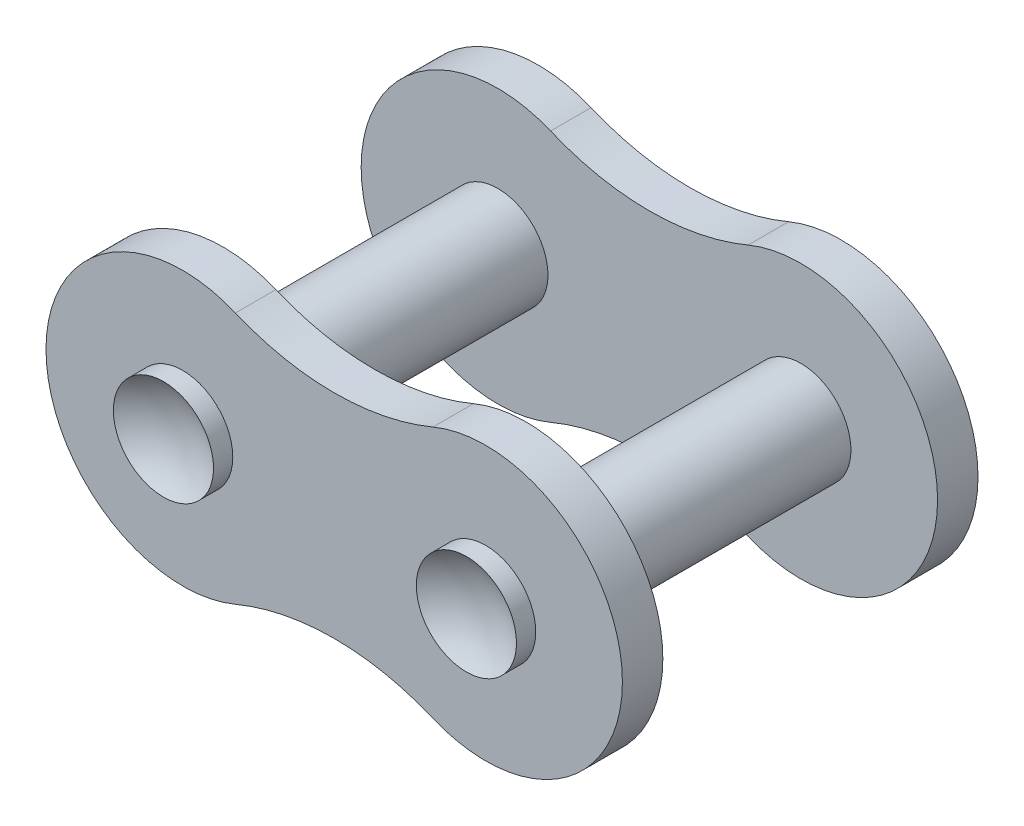
ISO-10303-21;
HEADER;
FILE_DESCRIPTION(('STEP AP214'),'2;1');
FILE_NAME('part.step','',(''),(''),'','','');
FILE_SCHEMA(('AUTOMOTIVE_DESIGN { 1 0 10303 214 1 1 1 1 }'));
ENDSEC;
DATA;
#1=APPLICATION_CONTEXT('core data for automotive mechanical design processes');
#2=APPLICATION_PROTOCOL_DEFINITION('international standard','automotive_design',2000,#1);
#3=PRODUCT_CONTEXT('',#1,'mechanical');
#4=PRODUCT('Part','Part','',(#3));
#5=PRODUCT_RELATED_PRODUCT_CATEGORY('part','',(#4));
#6=PRODUCT_DEFINITION_FORMATION('','',#4);
#7=PRODUCT_DEFINITION_CONTEXT('part definition',#1,'design');
#8=PRODUCT_DEFINITION('design','',#6,#7);
#9=PRODUCT_DEFINITION_SHAPE('','',#8);
#10=(LENGTH_UNIT() NAMED_UNIT(*) SI_UNIT(.MILLI.,.METRE.));
#11=(NAMED_UNIT(*) PLANE_ANGLE_UNIT() SI_UNIT($,.RADIAN.));
#12=(NAMED_UNIT(*) SI_UNIT($,.STERADIAN.) SOLID_ANGLE_UNIT());
#13=UNCERTAINTY_MEASURE_WITH_UNIT(LENGTH_MEASURE(1.E-05),#10,'distance_accuracy_value','');
#14=(GEOMETRIC_REPRESENTATION_CONTEXT(3) GLOBAL_UNCERTAINTY_ASSIGNED_CONTEXT((#13)) GLOBAL_UNIT_ASSIGNED_CONTEXT((#10,
#11,#12)) REPRESENTATION_CONTEXT('',''));
#15=CARTESIAN_POINT('',(0.,0.,0.));
#16=DIRECTION('',(0.,0.,1.));
#17=DIRECTION('',(1.,0.,0.));
#18=AXIS2_PLACEMENT_3D('',#15,#16,#17);
#19=CARTESIAN_POINT('',(-5.9944,0.,7.7978));
#20=DIRECTION('',(0.,0.,-1.));
#21=DIRECTION('',(-1.,0.,0.));
#22=AXIS2_PLACEMENT_3D('',#19,#20,#21);
#23=CYLINDRICAL_SURFACE('',#22,1.9812);
#24=CARTESIAN_POINT('',(-5.9944,0.,5.4356));
#25=DIRECTION('',(0.,0.,1.));
#26=DIRECTION('',(1.,0.,0.));
#27=AXIS2_PLACEMENT_3D('',#24,#25,#26);
#28=CIRCLE('',#27,1.9812);
#29=CARTESIAN_POINT('',(-4.0132,0.,5.4356));
#30=VERTEX_POINT('',#29);
#31=EDGE_CURVE('E163',#30,#30,#28,.T.);
#32=ORIENTED_EDGE('',*,*,#31,.F.);
#33=EDGE_LOOP('',(#32));
#34=FACE_BOUND('',#33,.T.);
#35=CARTESIAN_POINT('',(-5.9944,0.,-5.4356));
#36=DIRECTION('',(0.,0.,-1.));
#37=DIRECTION('',(-1.,0.,0.));
#38=AXIS2_PLACEMENT_3D('',#35,#36,#37);
#39=CIRCLE('',#38,1.9812);
#40=CARTESIAN_POINT('',(-7.9756,0.,-5.4356));
#41=VERTEX_POINT('',#40);
#42=EDGE_CURVE('E11',#41,#41,#39,.T.);
#43=ORIENTED_EDGE('',*,*,#42,.F.);
#44=EDGE_LOOP('',(#43));
#45=FACE_BOUND('',#44,.T.);
#46=ADVANCED_FACE('F33',(#34,#45),#23,.T.);
#47=CARTESIAN_POINT('',(5.9944,0.,7.7978));
#48=DIRECTION('',(0.,0.,-1.));
#49=DIRECTION('',(-1.,0.,0.));
#50=AXIS2_PLACEMENT_3D('',#47,#48,#49);
#51=CYLINDRICAL_SURFACE('',#50,1.9812);
#52=CARTESIAN_POINT('',(5.9944,0.,5.4356));
#53=DIRECTION('',(0.,0.,1.));
#54=DIRECTION('',(1.,0.,0.));
#55=AXIS2_PLACEMENT_3D('',#52,#53,#54);
#56=CIRCLE('',#55,1.9812);
#57=CARTESIAN_POINT('',(7.9756,0.,5.4356));
#58=VERTEX_POINT('',#57);
#59=EDGE_CURVE('E160',#58,#58,#56,.F.);
#60=ORIENTED_EDGE('',*,*,#59,.T.);
#61=EDGE_LOOP('',(#60));
#62=FACE_BOUND('',#61,.T.);
#63=CARTESIAN_POINT('',(5.9944,0.,-5.4356));
#64=DIRECTION('',(0.,0.,-1.));
#65=DIRECTION('',(-1.,0.,0.));
#66=AXIS2_PLACEMENT_3D('',#63,#64,#65);
#67=CIRCLE('',#66,1.9812);
#68=CARTESIAN_POINT('',(4.0132,0.,-5.4356));
#69=VERTEX_POINT('',#68);
#70=EDGE_CURVE('E37',#69,#69,#67,.T.);
#71=ORIENTED_EDGE('',*,*,#70,.F.);
#72=EDGE_LOOP('',(#71));
#73=FACE_BOUND('',#72,.T.);
#74=ADVANCED_FACE('F221',(#62,#73),#51,.T.);
#75=CARTESIAN_POINT('',(0.,14.3425233372653,5.4356));
#76=DIRECTION('',(0.,0.,1.));
#77=DIRECTION('',(1.,0.,0.));
#78=AXIS2_PLACEMENT_3D('',#75,#76,#77);
#79=CYLINDRICAL_SURFACE('',#78,10.1346);
#80=CARTESIAN_POINT('',(0.,14.3425233372653,7.0358));
#81=DIRECTION('',(0.,0.,-1.));
#82=DIRECTION('',(1.,0.,0.));
#83=AXIS2_PLACEMENT_3D('',#80,#81,#82);
#84=CIRCLE('',#83,10.1346);
#85=CARTESIAN_POINT('',(3.9081137254902,4.99176057326391,7.0358));
#86=VERTEX_POINT('',#85);
#87=CARTESIAN_POINT('',(-3.9081137254902,4.99176057326391,7.0358));
#88=VERTEX_POINT('',#87);
#89=EDGE_CURVE('E173',#86,#88,#84,.T.);
#90=ORIENTED_EDGE('',*,*,#89,.F.);
#91=DIRECTION('',(0.,0.,1.));
#92=VECTOR('',#91,1.);
#93=CARTESIAN_POINT('',(3.9081137254902,4.99176057326391,5.4356));
#94=LINE('',#93,#92);
#95=CARTESIAN_POINT('',(3.9081137254902,4.99176057326391,5.4356));
#96=VERTEX_POINT('',#95);
#97=EDGE_CURVE('E51',#96,#86,#94,.T.);
#98=ORIENTED_EDGE('',*,*,#97,.F.);
#99=CARTESIAN_POINT('',(0.,14.3425233372653,5.4356));
#100=DIRECTION('',(0.,0.,-1.));
#101=DIRECTION('',(1.,0.,0.));
#102=AXIS2_PLACEMENT_3D('',#99,#100,#101);
#103=CIRCLE('',#102,10.1346);
#104=CARTESIAN_POINT('',(-3.9081137254902,4.99176057326391,5.4356));
#105=VERTEX_POINT('',#104);
#106=EDGE_CURVE('E164',#96,#105,#103,.T.);
#107=ORIENTED_EDGE('',*,*,#106,.T.);
#108=DIRECTION('',(0.,0.,1.));
#109=VECTOR('',#108,1.);
#110=CARTESIAN_POINT('',(-3.9081137254902,4.99176057326391,5.4356));
#111=LINE('',#110,#109);
#112=EDGE_CURVE('E80',#105,#88,#111,.T.);
#113=ORIENTED_EDGE('',*,*,#112,.T.);
#114=EDGE_LOOP('',(#90,#98,#107,#113));
#115=FACE_BOUND('',#114,.T.);
#116=ADVANCED_FACE('F226',(#115),#79,.F.);
#117=CARTESIAN_POINT('',(5.9944,0.,5.4356));
#118=DIRECTION('',(0.,0.,1.));
#119=DIRECTION('',(1.,0.,0.));
#120=AXIS2_PLACEMENT_3D('',#117,#118,#119);
#121=CYLINDRICAL_SURFACE('',#120,5.4102);
#122=CARTESIAN_POINT('',(5.9944,0.,7.0358));
#123=DIRECTION('',(0.,0.,1.));
#124=DIRECTION('',(1.,0.,0.));
#125=AXIS2_PLACEMENT_3D('',#122,#123,#124);
#126=CIRCLE('',#125,5.4102);
#127=CARTESIAN_POINT('',(3.9081137254902,-4.9917605732639,7.0358));
#128=VERTEX_POINT('',#127);
#129=EDGE_CURVE('E167',#128,#86,#126,.T.);
#130=ORIENTED_EDGE('',*,*,#129,.F.);
#131=DIRECTION('',(0.,0.,1.));
#132=VECTOR('',#131,1.);
#133=CARTESIAN_POINT('',(3.9081137254902,-4.9917605732639,5.4356));
#134=LINE('',#133,#132);
#135=CARTESIAN_POINT('',(3.9081137254902,-4.9917605732639,5.4356));
#136=VERTEX_POINT('',#135);
#137=EDGE_CURVE('E69',#136,#128,#134,.T.);
#138=ORIENTED_EDGE('',*,*,#137,.F.);
#139=CARTESIAN_POINT('',(5.9944,0.,5.4356));
#140=DIRECTION('',(0.,0.,1.));
#141=DIRECTION('',(1.,0.,0.));
#142=AXIS2_PLACEMENT_3D('',#139,#140,#141);
#143=CIRCLE('',#142,5.4102);
#144=EDGE_CURVE('E171',#136,#96,#143,.T.);
#145=ORIENTED_EDGE('',*,*,#144,.T.);
#146=ORIENTED_EDGE('',*,*,#97,.T.);
#147=EDGE_LOOP('',(#130,#138,#145,#146));
#148=FACE_BOUND('',#147,.T.);
#149=ADVANCED_FACE('F388',(#148),#121,.T.);
#150=CARTESIAN_POINT('',(0.,-14.3425233372653,5.4356));
#151=DIRECTION('',(0.,0.,1.));
#152=DIRECTION('',(1.,0.,0.));
#153=AXIS2_PLACEMENT_3D('',#150,#151,#152);
#154=CYLINDRICAL_SURFACE('',#153,10.1346);
#155=CARTESIAN_POINT('',(0.,-14.3425233372653,7.0358));
#156=DIRECTION('',(0.,0.,-1.));
#157=DIRECTION('',(-1.,0.,0.));
#158=AXIS2_PLACEMENT_3D('',#155,#156,#157);
#159=CIRCLE('',#158,10.1346);
#160=CARTESIAN_POINT('',(-3.9081137254902,-4.99176057326391,7.0358));
#161=VERTEX_POINT('',#160);
#162=EDGE_CURVE('E179',#161,#128,#159,.T.);
#163=ORIENTED_EDGE('',*,*,#162,.F.);
#164=DIRECTION('',(0.,0.,1.));
#165=VECTOR('',#164,1.);
#166=CARTESIAN_POINT('',(-3.9081137254902,-4.99176057326391,5.4356));
#167=LINE('',#166,#165);
#168=CARTESIAN_POINT('',(-3.9081137254902,-4.99176057326391,5.4356));
#169=VERTEX_POINT('',#168);
#170=EDGE_CURVE('E186',#169,#161,#167,.T.);
#171=ORIENTED_EDGE('',*,*,#170,.F.);
#172=CARTESIAN_POINT('',(0.,-14.3425233372653,5.4356));
#173=DIRECTION('',(0.,0.,-1.));
#174=DIRECTION('',(-1.,0.,0.));
#175=AXIS2_PLACEMENT_3D('',#172,#173,#174);
#176=CIRCLE('',#175,10.1346);
#177=EDGE_CURVE('E169',#169,#136,#176,.T.);
#178=ORIENTED_EDGE('',*,*,#177,.T.);
#179=ORIENTED_EDGE('',*,*,#137,.T.);
#180=EDGE_LOOP('',(#163,#171,#178,#179));
#181=FACE_BOUND('',#180,.T.);
#182=ADVANCED_FACE('F380',(#181),#154,.F.);
#183=CARTESIAN_POINT('',(-5.9944,0.,5.4356));
#184=DIRECTION('',(0.,0.,1.));
#185=DIRECTION('',(1.,0.,0.));
#186=AXIS2_PLACEMENT_3D('',#183,#184,#185);
#187=CYLINDRICAL_SURFACE('',#186,5.4102);
#188=CARTESIAN_POINT('',(-5.9944,0.,7.0358));
#189=DIRECTION('',(0.,0.,1.));
#190=DIRECTION('',(1.,0.,0.));
#191=AXIS2_PLACEMENT_3D('',#188,#189,#190);
#192=CIRCLE('',#191,5.4102);
#193=EDGE_CURVE('E176',#88,#161,#192,.T.);
#194=ORIENTED_EDGE('',*,*,#193,.F.);
#195=ORIENTED_EDGE('',*,*,#112,.F.);
#196=CARTESIAN_POINT('',(-5.9944,0.,5.4356));
#197=DIRECTION('',(0.,0.,1.));
#198=DIRECTION('',(1.,0.,0.));
#199=AXIS2_PLACEMENT_3D('',#196,#197,#198);
#200=CIRCLE('',#199,5.4102);
#201=EDGE_CURVE('E166',#105,#169,#200,.T.);
#202=ORIENTED_EDGE('',*,*,#201,.T.);
#203=ORIENTED_EDGE('',*,*,#170,.T.);
#204=EDGE_LOOP('',(#194,#195,#202,#203));
#205=FACE_BOUND('',#204,.T.);
#206=ADVANCED_FACE('F371',(#205),#187,.T.);
#207=CARTESIAN_POINT('',(2.9972,7.17126166863266,5.4356));
#208=DIRECTION('',(0.,0.,1.));
#209=DIRECTION('',(1.,0.,0.));
#210=AXIS2_PLACEMENT_3D('',#207,#208,#209);
#211=PLANE('',#210);
#212=ORIENTED_EDGE('',*,*,#59,.F.);
#213=EDGE_LOOP('',(#212));
#214=FACE_BOUND('',#213,.T.);
#215=ORIENTED_EDGE('',*,*,#31,.T.);
#216=EDGE_LOOP('',(#215));
#217=FACE_BOUND('',#216,.T.);
#218=ORIENTED_EDGE('',*,*,#106,.F.);
#219=ORIENTED_EDGE('',*,*,#144,.F.);
#220=ORIENTED_EDGE('',*,*,#177,.F.);
#221=ORIENTED_EDGE('',*,*,#201,.F.);
#222=EDGE_LOOP('',(#218,#219,#220,#221));
#223=FACE_BOUND('',#222,.T.);
#224=ADVANCED_FACE('F242',(#214,#217,#223),#211,.F.);
#225=CARTESIAN_POINT('',(2.9972,7.17126166863266,7.0358));
#226=DIRECTION('',(0.,0.,1.));
#227=DIRECTION('',(1.,0.,0.));
#228=AXIS2_PLACEMENT_3D('',#225,#226,#227);
#229=PLANE('',#228);
#230=CARTESIAN_POINT('',(5.9944,0.,7.0358));
#231=DIRECTION('',(0.,0.,1.));
#232=DIRECTION('',(1.,0.,0.));
#233=AXIS2_PLACEMENT_3D('',#230,#231,#232);
#234=CIRCLE('',#233,1.9812);
#235=CARTESIAN_POINT('',(7.9756,0.,7.0358));
#236=VERTEX_POINT('',#235);
#237=EDGE_CURVE('E158',#236,#236,#234,.F.);
#238=ORIENTED_EDGE('',*,*,#237,.T.);
#239=EDGE_LOOP('',(#238));
#240=FACE_BOUND('',#239,.T.);
#241=CARTESIAN_POINT('',(-5.9944,0.,7.0358));
#242=DIRECTION('',(0.,0.,1.));
#243=DIRECTION('',(1.,0.,0.));
#244=AXIS2_PLACEMENT_3D('',#241,#242,#243);
#245=CIRCLE('',#244,1.9812);
#246=CARTESIAN_POINT('',(-4.0132,0.,7.0358));
#247=VERTEX_POINT('',#246);
#248=EDGE_CURVE('E184',#247,#247,#245,.T.);
#249=ORIENTED_EDGE('',*,*,#248,.F.);
#250=EDGE_LOOP('',(#249));
#251=FACE_BOUND('',#250,.T.);
#252=ORIENTED_EDGE('',*,*,#89,.T.);
#253=ORIENTED_EDGE('',*,*,#193,.T.);
#254=ORIENTED_EDGE('',*,*,#162,.T.);
#255=ORIENTED_EDGE('',*,*,#129,.T.);
#256=EDGE_LOOP('',(#252,#253,#254,#255));
#257=FACE_BOUND('',#256,.T.);
#258=ADVANCED_FACE('F235',(#240,#251,#257),#229,.T.);
#259=ORIENTED_EDGE('',*,*,#248,.T.);
#260=EDGE_LOOP('',(#259));
#261=FACE_BOUND('',#260,.T.);
#262=CARTESIAN_POINT('',(-5.9944,0.,7.7978));
#263=DIRECTION('',(0.,0.,1.));
#264=DIRECTION('',(1.,0.,0.));
#265=AXIS2_PLACEMENT_3D('',#262,#263,#264);
#266=CIRCLE('',#265,1.9812);
#267=CARTESIAN_POINT('',(-4.0132,0.,7.7978));
#268=VERTEX_POINT('',#267);
#269=EDGE_CURVE('E140',#268,#268,#266,.T.);
#270=ORIENTED_EDGE('',*,*,#269,.F.);
#271=EDGE_LOOP('',(#270));
#272=FACE_BOUND('',#271,.T.);
#273=ADVANCED_FACE('F35',(#261,#272),#23,.T.);
#274=ORIENTED_EDGE('',*,*,#237,.F.);
#275=EDGE_LOOP('',(#274));
#276=FACE_BOUND('',#275,.T.);
#277=CARTESIAN_POINT('',(5.9944,0.,7.7978));
#278=DIRECTION('',(0.,0.,-1.));
#279=DIRECTION('',(-1.,0.,0.));
#280=AXIS2_PLACEMENT_3D('',#277,#278,#279);
#281=CIRCLE('',#280,1.9812);
#282=CARTESIAN_POINT('',(4.0132,0.,7.7978));
#283=VERTEX_POINT('',#282);
#284=EDGE_CURVE('E253',#283,#283,#281,.T.);
#285=ORIENTED_EDGE('',*,*,#284,.T.);
#286=EDGE_LOOP('',(#285));
#287=FACE_BOUND('',#286,.T.);
#288=ADVANCED_FACE('F229',(#276,#287),#51,.T.);
#289=CARTESIAN_POINT('',(0.,14.3425233372653,-5.4356));
#290=DIRECTION('',(0.,0.,-1.));
#291=DIRECTION('',(-1.,0.,0.));
#292=AXIS2_PLACEMENT_3D('',#289,#290,#291);
#293=CYLINDRICAL_SURFACE('',#292,10.1346);
#294=CARTESIAN_POINT('',(0.,14.3425233372653,-7.0358));
#295=DIRECTION('',(0.,0.,-1.));
#296=DIRECTION('',(1.,0.,0.));
#297=AXIS2_PLACEMENT_3D('',#294,#295,#296);
#298=CIRCLE('',#297,10.1346);
#299=CARTESIAN_POINT('',(3.9081137254902,4.99176057326391,-7.0358));
#300=VERTEX_POINT('',#299);
#301=CARTESIAN_POINT('',(-3.9081137254902,4.99176057326391,-7.0358));
#302=VERTEX_POINT('',#301);
#303=EDGE_CURVE('E145',#300,#302,#298,.T.);
#304=ORIENTED_EDGE('',*,*,#303,.T.);
#305=DIRECTION('',(0.,0.,-1.));
#306=VECTOR('',#305,1.);
#307=CARTESIAN_POINT('',(-3.9081137254902,4.99176057326391,-5.4356));
#308=LINE('',#307,#306);
#309=CARTESIAN_POINT('',(-3.9081137254902,4.99176057326391,-5.4356));
#310=VERTEX_POINT('',#309);
#311=EDGE_CURVE('E134',#310,#302,#308,.T.);
#312=ORIENTED_EDGE('',*,*,#311,.F.);
#313=CARTESIAN_POINT('',(0.,14.3425233372653,-5.4356));
#314=DIRECTION('',(0.,0.,-1.));
#315=DIRECTION('',(1.,0.,0.));
#316=AXIS2_PLACEMENT_3D('',#313,#314,#315);
#317=CIRCLE('',#316,10.1346);
#318=CARTESIAN_POINT('',(3.9081137254902,4.99176057326391,-5.4356));
#319=VERTEX_POINT('',#318);
#320=EDGE_CURVE('E113',#319,#310,#317,.T.);
#321=ORIENTED_EDGE('',*,*,#320,.F.);
#322=DIRECTION('',(0.,0.,-1.));
#323=VECTOR('',#322,1.);
#324=CARTESIAN_POINT('',(3.9081137254902,4.99176057326391,-5.4356));
#325=LINE('',#324,#323);
#326=EDGE_CURVE('E122',#319,#300,#325,.T.);
#327=ORIENTED_EDGE('',*,*,#326,.T.);
#328=EDGE_LOOP('',(#304,#312,#321,#327));
#329=FACE_BOUND('',#328,.T.);
#330=ADVANCED_FACE('F132',(#329),#293,.F.);
#331=CARTESIAN_POINT('',(-5.9944,0.,-5.4356));
#332=DIRECTION('',(0.,0.,-1.));
#333=DIRECTION('',(-1.,0.,0.));
#334=AXIS2_PLACEMENT_3D('',#331,#332,#333);
#335=CYLINDRICAL_SURFACE('',#334,5.4102);
#336=CARTESIAN_POINT('',(-5.9944,0.,-7.0358));
#337=DIRECTION('',(0.,0.,1.));
#338=DIRECTION('',(1.,0.,0.));
#339=AXIS2_PLACEMENT_3D('',#336,#337,#338);
#340=CIRCLE('',#339,5.4102);
#341=CARTESIAN_POINT('',(-3.9081137254902,-4.99176057326391,-7.0358));
#342=VERTEX_POINT('',#341);
#343=EDGE_CURVE('E135',#302,#342,#340,.T.);
#344=ORIENTED_EDGE('',*,*,#343,.T.);
#345=DIRECTION('',(0.,0.,-1.));
#346=VECTOR('',#345,1.);
#347=CARTESIAN_POINT('',(-3.9081137254902,-4.99176057326391,-5.4356));
#348=LINE('',#347,#346);
#349=CARTESIAN_POINT('',(-3.9081137254902,-4.99176057326391,-5.4356));
#350=VERTEX_POINT('',#349);
#351=EDGE_CURVE('E152',#350,#342,#348,.T.);
#352=ORIENTED_EDGE('',*,*,#351,.F.);
#353=CARTESIAN_POINT('',(-5.9944,0.,-5.4356));
#354=DIRECTION('',(0.,0.,1.));
#355=DIRECTION('',(1.,0.,0.));
#356=AXIS2_PLACEMENT_3D('',#353,#354,#355);
#357=CIRCLE('',#356,5.4102);
#358=EDGE_CURVE('E130',#310,#350,#357,.T.);
#359=ORIENTED_EDGE('',*,*,#358,.F.);
#360=ORIENTED_EDGE('',*,*,#311,.T.);
#361=EDGE_LOOP('',(#344,#352,#359,#360));
#362=FACE_BOUND('',#361,.T.);
#363=ADVANCED_FACE('F209',(#362),#335,.T.);
#364=CARTESIAN_POINT('',(0.,-14.3425233372653,-5.4356));
#365=DIRECTION('',(0.,0.,-1.));
#366=DIRECTION('',(-1.,0.,0.));
#367=AXIS2_PLACEMENT_3D('',#364,#365,#366);
#368=CYLINDRICAL_SURFACE('',#367,10.1346);
#369=CARTESIAN_POINT('',(0.,-14.3425233372653,-7.0358));
#370=DIRECTION('',(0.,0.,-1.));
#371=DIRECTION('',(-1.,0.,0.));
#372=AXIS2_PLACEMENT_3D('',#369,#370,#371);
#373=CIRCLE('',#372,10.1346);
#374=CARTESIAN_POINT('',(3.9081137254902,-4.9917605732639,-7.0358));
#375=VERTEX_POINT('',#374);
#376=EDGE_CURVE('E137',#342,#375,#373,.T.);
#377=ORIENTED_EDGE('',*,*,#376,.T.);
#378=DIRECTION('',(0.,0.,-1.));
#379=VECTOR('',#378,1.);
#380=CARTESIAN_POINT('',(3.9081137254902,-4.9917605732639,-5.4356));
#381=LINE('',#380,#379);
#382=CARTESIAN_POINT('',(3.9081137254902,-4.9917605732639,-5.4356));
#383=VERTEX_POINT('',#382);
#384=EDGE_CURVE('E129',#383,#375,#381,.T.);
#385=ORIENTED_EDGE('',*,*,#384,.F.);
#386=CARTESIAN_POINT('',(0.,-14.3425233372653,-5.4356));
#387=DIRECTION('',(0.,0.,-1.));
#388=DIRECTION('',(-1.,0.,0.));
#389=AXIS2_PLACEMENT_3D('',#386,#387,#388);
#390=CIRCLE('',#389,10.1346);
#391=EDGE_CURVE('E116',#350,#383,#390,.T.);
#392=ORIENTED_EDGE('',*,*,#391,.F.);
#393=ORIENTED_EDGE('',*,*,#351,.T.);
#394=EDGE_LOOP('',(#377,#385,#392,#393));
#395=FACE_BOUND('',#394,.T.);
#396=ADVANCED_FACE('F211',(#395),#368,.F.);
#397=CARTESIAN_POINT('',(5.9944,0.,-5.4356));
#398=DIRECTION('',(0.,0.,-1.));
#399=DIRECTION('',(-1.,0.,0.));
#400=AXIS2_PLACEMENT_3D('',#397,#398,#399);
#401=CYLINDRICAL_SURFACE('',#400,5.4102);
#402=CARTESIAN_POINT('',(5.9944,0.,-7.0358));
#403=DIRECTION('',(0.,0.,1.));
#404=DIRECTION('',(1.,0.,0.));
#405=AXIS2_PLACEMENT_3D('',#402,#403,#404);
#406=CIRCLE('',#405,5.4102);
#407=EDGE_CURVE('E125',#375,#300,#406,.T.);
#408=ORIENTED_EDGE('',*,*,#407,.T.);
#409=ORIENTED_EDGE('',*,*,#326,.F.);
#410=CARTESIAN_POINT('',(5.9944,0.,-5.4356));
#411=DIRECTION('',(0.,0.,1.));
#412=DIRECTION('',(1.,0.,0.));
#413=AXIS2_PLACEMENT_3D('',#410,#411,#412);
#414=CIRCLE('',#413,5.4102);
#415=EDGE_CURVE('E109',#383,#319,#414,.T.);
#416=ORIENTED_EDGE('',*,*,#415,.F.);
#417=ORIENTED_EDGE('',*,*,#384,.T.);
#418=EDGE_LOOP('',(#408,#409,#416,#417));
#419=FACE_BOUND('',#418,.T.);
#420=ADVANCED_FACE('F123',(#419),#401,.T.);
#421=CARTESIAN_POINT('',(2.9972,7.17126166863266,-5.4356));
#422=DIRECTION('',(0.,0.,-1.));
#423=DIRECTION('',(1.,0.,0.));
#424=AXIS2_PLACEMENT_3D('',#421,#422,#423);
#425=PLANE('',#424);
#426=ORIENTED_EDGE('',*,*,#42,.T.);
#427=EDGE_LOOP('',(#426));
#428=FACE_BOUND('',#427,.T.);
#429=ORIENTED_EDGE('',*,*,#70,.T.);
#430=EDGE_LOOP('',(#429));
#431=FACE_BOUND('',#430,.T.);
#432=ORIENTED_EDGE('',*,*,#320,.T.);
#433=ORIENTED_EDGE('',*,*,#358,.T.);
#434=ORIENTED_EDGE('',*,*,#391,.T.);
#435=ORIENTED_EDGE('',*,*,#415,.T.);
#436=EDGE_LOOP('',(#432,#433,#434,#435));
#437=FACE_BOUND('',#436,.T.);
#438=ADVANCED_FACE('F111',(#428,#431,#437),#425,.F.);
#439=CARTESIAN_POINT('',(2.9972,7.17126166863266,-7.0358));
#440=DIRECTION('',(0.,0.,-1.));
#441=DIRECTION('',(1.,0.,0.));
#442=AXIS2_PLACEMENT_3D('',#439,#440,#441);
#443=PLANE('',#442);
#444=CARTESIAN_POINT('',(-5.9944,0.,-7.0358));
#445=DIRECTION('',(0.,0.,-1.));
#446=DIRECTION('',(-1.,0.,0.));
#447=AXIS2_PLACEMENT_3D('',#444,#445,#446);
#448=CIRCLE('',#447,1.9812);
#449=CARTESIAN_POINT('',(-7.9756,0.,-7.0358));
#450=VERTEX_POINT('',#449);
#451=EDGE_CURVE('E156',#450,#450,#448,.T.);
#452=ORIENTED_EDGE('',*,*,#451,.F.);
#453=EDGE_LOOP('',(#452));
#454=FACE_BOUND('',#453,.T.);
#455=CARTESIAN_POINT('',(5.9944,0.,-7.0358));
#456=DIRECTION('',(0.,0.,-1.));
#457=DIRECTION('',(-1.,0.,0.));
#458=AXIS2_PLACEMENT_3D('',#455,#456,#457);
#459=CIRCLE('',#458,1.9812);
#460=CARTESIAN_POINT('',(4.0132,0.,-7.0358));
#461=VERTEX_POINT('',#460);
#462=EDGE_CURVE('E151',#461,#461,#459,.T.);
#463=ORIENTED_EDGE('',*,*,#462,.F.);
#464=EDGE_LOOP('',(#463));
#465=FACE_BOUND('',#464,.T.);
#466=ORIENTED_EDGE('',*,*,#303,.F.);
#467=ORIENTED_EDGE('',*,*,#407,.F.);
#468=ORIENTED_EDGE('',*,*,#376,.F.);
#469=ORIENTED_EDGE('',*,*,#343,.F.);
#470=EDGE_LOOP('',(#466,#467,#468,#469));
#471=FACE_BOUND('',#470,.T.);
#472=ADVANCED_FACE('F200',(#454,#465,#471),#443,.T.);
#473=ORIENTED_EDGE('',*,*,#451,.T.);
#474=EDGE_LOOP('',(#473));
#475=FACE_BOUND('',#474,.T.);
#476=CARTESIAN_POINT('',(-5.9944,0.,-7.7978));
#477=DIRECTION('',(0.,0.,1.));
#478=DIRECTION('',(1.,0.,0.));
#479=AXIS2_PLACEMENT_3D('',#476,#477,#478);
#480=CIRCLE('',#479,1.9812);
#481=CARTESIAN_POINT('',(-4.0132,0.,-7.7978));
#482=VERTEX_POINT('',#481);
#483=EDGE_CURVE('E147',#482,#482,#480,.T.);
#484=ORIENTED_EDGE('',*,*,#483,.T.);
#485=EDGE_LOOP('',(#484));
#486=FACE_BOUND('',#485,.T.);
#487=ADVANCED_FACE('F203',(#475,#486),#23,.T.);
#488=ORIENTED_EDGE('',*,*,#462,.T.);
#489=EDGE_LOOP('',(#488));
#490=FACE_BOUND('',#489,.T.);
#491=CARTESIAN_POINT('',(5.9944,0.,-7.7978));
#492=DIRECTION('',(0.,0.,-1.));
#493=DIRECTION('',(-1.,0.,0.));
#494=AXIS2_PLACEMENT_3D('',#491,#492,#493);
#495=CIRCLE('',#494,1.9812);
#496=CARTESIAN_POINT('',(4.0132,0.,-7.7978));
#497=VERTEX_POINT('',#496);
#498=EDGE_CURVE('E250',#497,#497,#495,.T.);
#499=ORIENTED_EDGE('',*,*,#498,.F.);
#500=EDGE_LOOP('',(#499));
#501=FACE_BOUND('',#500,.T.);
#502=ADVANCED_FACE('F197',(#490,#501),#51,.T.);
#503=CARTESIAN_POINT('',(-5.9944,0.,-10.4394));
#504=DIRECTION('',(0.,0.,1.));
#505=DIRECTION('',(-1.,0.,0.));
#506=AXIS2_PLACEMENT_3D('',#503,#504,#505);
#507=SPHERICAL_SURFACE('',#506,3.302);
#508=ORIENTED_EDGE('',*,*,#483,.F.);
#509=EDGE_LOOP('',(#508));
#510=FACE_BOUND('',#509,.T.);
#511=ADVANCED_FACE('F272',(#510),#507,.F.);
#512=CARTESIAN_POINT('',(-5.9944,0.,10.4394));
#513=DIRECTION('',(0.,0.,1.));
#514=DIRECTION('',(-1.,0.,0.));
#515=AXIS2_PLACEMENT_3D('',#512,#513,#514);
#516=SPHERICAL_SURFACE('',#515,3.302);
#517=ORIENTED_EDGE('',*,*,#269,.T.);
#518=EDGE_LOOP('',(#517));
#519=FACE_BOUND('',#518,.T.);
#520=ADVANCED_FACE('F269',(#519),#516,.F.);
#521=CARTESIAN_POINT('',(5.9944,0.,-10.4394));
#522=DIRECTION('',(0.,0.,1.));
#523=DIRECTION('',(1.,0.,0.));
#524=AXIS2_PLACEMENT_3D('',#521,#522,#523);
#525=SPHERICAL_SURFACE('',#524,3.302);
#526=ORIENTED_EDGE('',*,*,#498,.T.);
#527=EDGE_LOOP('',(#526));
#528=FACE_BOUND('',#527,.T.);
#529=ADVANCED_FACE('F264',(#528),#525,.F.);
#530=CARTESIAN_POINT('',(5.9944,0.,10.4394));
#531=DIRECTION('',(0.,0.,1.));
#532=DIRECTION('',(1.,0.,0.));
#533=AXIS2_PLACEMENT_3D('',#530,#531,#532);
#534=SPHERICAL_SURFACE('',#533,3.302);
#535=ORIENTED_EDGE('',*,*,#284,.F.);
#536=EDGE_LOOP('',(#535));
#537=FACE_BOUND('',#536,.T.);
#538=ADVANCED_FACE('F262',(#537),#534,.F.);
#539=CLOSED_SHELL('',(#46,#74,#116,#149,#182,#206,#224,#258,#273,#288,#330,#363,#396,#420,#438,
#472,#487,#502,#511,#520,#529,#538));
#540=MANIFOLD_SOLID_BREP('B2',#539);
#541=ADVANCED_BREP_SHAPE_REPRESENTATION('',(#18,#540),#14);
#542=SHAPE_DEFINITION_REPRESENTATION(#9,#541);
ENDSEC;
END-ISO-10303-21;
